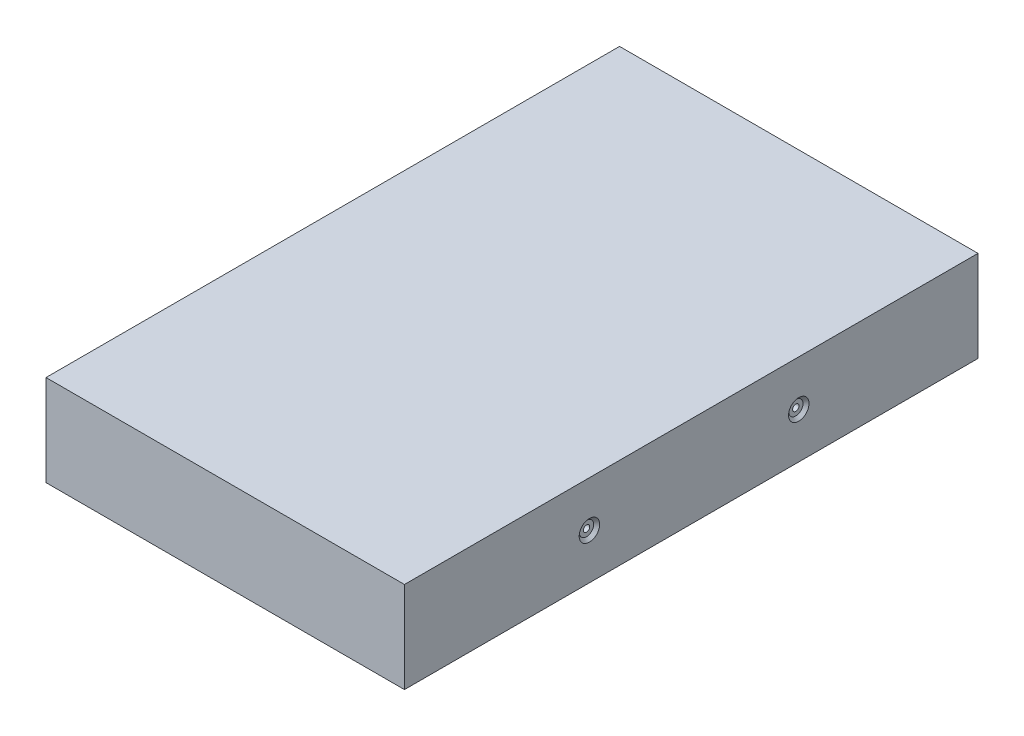
ISO-10303-21;
HEADER;
FILE_DESCRIPTION(('STEP AP214'),'2;1');
FILE_NAME('part.step','',(''),(''),'','','');
FILE_SCHEMA(('AUTOMOTIVE_DESIGN { 1 0 10303 214 1 1 1 1 }'));
ENDSEC;
DATA;
#1=APPLICATION_CONTEXT('core data for automotive mechanical design processes');
#2=APPLICATION_PROTOCOL_DEFINITION('international standard','automotive_design',2000,#1);
#3=PRODUCT_CONTEXT('',#1,'mechanical');
#4=PRODUCT('Part','Part','',(#3));
#5=PRODUCT_RELATED_PRODUCT_CATEGORY('part','',(#4));
#6=PRODUCT_DEFINITION_FORMATION('','',#4);
#7=PRODUCT_DEFINITION_CONTEXT('part definition',#1,'design');
#8=PRODUCT_DEFINITION('design','',#6,#7);
#9=PRODUCT_DEFINITION_SHAPE('','',#8);
#10=(LENGTH_UNIT() NAMED_UNIT(*) SI_UNIT(.MILLI.,.METRE.));
#11=(NAMED_UNIT(*) PLANE_ANGLE_UNIT() SI_UNIT($,.RADIAN.));
#12=(NAMED_UNIT(*) SI_UNIT($,.STERADIAN.) SOLID_ANGLE_UNIT());
#13=UNCERTAINTY_MEASURE_WITH_UNIT(LENGTH_MEASURE(1.E-05),#10,'distance_accuracy_value','');
#14=(GEOMETRIC_REPRESENTATION_CONTEXT(3) GLOBAL_UNCERTAINTY_ASSIGNED_CONTEXT((#13)) GLOBAL_UNIT_ASSIGNED_CONTEXT((#10,
#11,#12)) REPRESENTATION_CONTEXT('',''));
#15=CARTESIAN_POINT('',(0.,0.,0.));
#16=DIRECTION('',(0.,0.,1.));
#17=DIRECTION('',(1.,0.,0.));
#18=AXIS2_PLACEMENT_3D('',#15,#16,#17);
#19=CARTESIAN_POINT('',(50.,25.4,-80.));
#20=DIRECTION('',(-1.,0.,0.));
#21=DIRECTION('',(0.,0.,1.));
#22=AXIS2_PLACEMENT_3D('',#19,#20,#21);
#23=PLANE('',#22);
#24=CARTESIAN_POINT('',(50.,12.7,28.4));
#25=DIRECTION('',(1.,0.,0.));
#26=DIRECTION('',(0.,0.,-1.));
#27=AXIS2_PLACEMENT_3D('',#24,#25,#26);
#28=CIRCLE('',#27,2.8575);
#29=CARTESIAN_POINT('',(50.,12.7,25.5425));
#30=VERTEX_POINT('',#29);
#31=EDGE_CURVE('E176',#30,#30,#28,.T.);
#32=ORIENTED_EDGE('',*,*,#31,.F.);
#33=EDGE_LOOP('',(#32));
#34=FACE_BOUND('',#33,.T.);
#35=CARTESIAN_POINT('',(50.,12.7,-30.));
#36=DIRECTION('',(1.,0.,0.));
#37=DIRECTION('',(0.,0.,-1.));
#38=AXIS2_PLACEMENT_3D('',#35,#36,#37);
#39=CIRCLE('',#38,2.8575);
#40=CARTESIAN_POINT('',(50.,12.7,-32.8575));
#41=VERTEX_POINT('',#40);
#42=EDGE_CURVE('E110',#41,#41,#39,.T.);
#43=ORIENTED_EDGE('',*,*,#42,.F.);
#44=EDGE_LOOP('',(#43));
#45=FACE_BOUND('',#44,.T.);
#46=DIRECTION('',(0.,0.,-1.));
#47=VECTOR('',#46,1.);
#48=CARTESIAN_POINT('',(50.,0.,-80.));
#49=LINE('',#48,#47);
#50=CARTESIAN_POINT('',(50.,0.,80.));
#51=VERTEX_POINT('',#50);
#52=CARTESIAN_POINT('',(50.,0.,-80.));
#53=VERTEX_POINT('',#52);
#54=EDGE_CURVE('E132',#51,#53,#49,.T.);
#55=ORIENTED_EDGE('',*,*,#54,.T.);
#56=DIRECTION('',(0.,-1.,0.));
#57=VECTOR('',#56,1.);
#58=CARTESIAN_POINT('',(50.,25.4,-80.));
#59=LINE('',#58,#57);
#60=CARTESIAN_POINT('',(50.,25.4,-80.));
#61=VERTEX_POINT('',#60);
#62=EDGE_CURVE('E13',#61,#53,#59,.T.);
#63=ORIENTED_EDGE('',*,*,#62,.F.);
#64=DIRECTION('',(0.,0.,-1.));
#65=VECTOR('',#64,1.);
#66=CARTESIAN_POINT('',(50.,25.4,-80.));
#67=LINE('',#66,#65);
#68=CARTESIAN_POINT('',(50.,25.4,80.));
#69=VERTEX_POINT('',#68);
#70=EDGE_CURVE('E133',#69,#61,#67,.T.);
#71=ORIENTED_EDGE('',*,*,#70,.F.);
#72=DIRECTION('',(0.,-1.,0.));
#73=VECTOR('',#72,1.);
#74=CARTESIAN_POINT('',(50.,25.4,80.));
#75=LINE('',#74,#73);
#76=EDGE_CURVE('E139',#69,#51,#75,.T.);
#77=ORIENTED_EDGE('',*,*,#76,.T.);
#78=EDGE_LOOP('',(#55,#63,#71,#77));
#79=FACE_BOUND('',#78,.T.);
#80=ADVANCED_FACE('F46',(#34,#45,#79),#23,.F.);
#81=CARTESIAN_POINT('',(-50.,25.4,-80.));
#82=DIRECTION('',(0.,0.,1.));
#83=DIRECTION('',(1.,0.,0.));
#84=AXIS2_PLACEMENT_3D('',#81,#82,#83);
#85=PLANE('',#84);
#86=DIRECTION('',(-1.,0.,0.));
#87=VECTOR('',#86,1.);
#88=CARTESIAN_POINT('',(-50.,0.,-80.));
#89=LINE('',#88,#87);
#90=CARTESIAN_POINT('',(-50.,0.,-80.));
#91=VERTEX_POINT('',#90);
#92=EDGE_CURVE('E142',#53,#91,#89,.T.);
#93=ORIENTED_EDGE('',*,*,#92,.T.);
#94=DIRECTION('',(0.,-1.,0.));
#95=VECTOR('',#94,1.);
#96=CARTESIAN_POINT('',(-50.,25.4,-80.));
#97=LINE('',#96,#95);
#98=CARTESIAN_POINT('',(-50.,25.4,-80.));
#99=VERTEX_POINT('',#98);
#100=EDGE_CURVE('E54',#99,#91,#97,.T.);
#101=ORIENTED_EDGE('',*,*,#100,.F.);
#102=DIRECTION('',(-1.,0.,0.));
#103=VECTOR('',#102,1.);
#104=CARTESIAN_POINT('',(-50.,25.4,-80.));
#105=LINE('',#104,#103);
#106=EDGE_CURVE('E93',#61,#99,#105,.T.);
#107=ORIENTED_EDGE('',*,*,#106,.F.);
#108=ORIENTED_EDGE('',*,*,#62,.T.);
#109=EDGE_LOOP('',(#93,#101,#107,#108));
#110=FACE_BOUND('',#109,.T.);
#111=ADVANCED_FACE('F165',(#110),#85,.F.);
#112=CARTESIAN_POINT('',(-50.,25.4,-80.));
#113=DIRECTION('',(1.,0.,0.));
#114=DIRECTION('',(0.,0.,-1.));
#115=AXIS2_PLACEMENT_3D('',#112,#113,#114);
#116=PLANE('',#115);
#117=DIRECTION('',(0.,0.,1.));
#118=VECTOR('',#117,1.);
#119=CARTESIAN_POINT('',(-50.,0.,-80.));
#120=LINE('',#119,#118);
#121=CARTESIAN_POINT('',(-50.,0.,80.));
#122=VERTEX_POINT('',#121);
#123=EDGE_CURVE('E80',#91,#122,#120,.T.);
#124=ORIENTED_EDGE('',*,*,#123,.T.);
#125=DIRECTION('',(0.,-1.,0.));
#126=VECTOR('',#125,1.);
#127=CARTESIAN_POINT('',(-50.,25.4,80.));
#128=LINE('',#127,#126);
#129=CARTESIAN_POINT('',(-50.,25.4,80.));
#130=VERTEX_POINT('',#129);
#131=EDGE_CURVE('E147',#130,#122,#128,.T.);
#132=ORIENTED_EDGE('',*,*,#131,.F.);
#133=DIRECTION('',(0.,0.,1.));
#134=VECTOR('',#133,1.);
#135=CARTESIAN_POINT('',(-50.,25.4,-80.));
#136=LINE('',#135,#134);
#137=EDGE_CURVE('E136',#99,#130,#136,.T.);
#138=ORIENTED_EDGE('',*,*,#137,.F.);
#139=ORIENTED_EDGE('',*,*,#100,.T.);
#140=EDGE_LOOP('',(#124,#132,#138,#139));
#141=FACE_BOUND('',#140,.T.);
#142=ADVANCED_FACE('F149',(#141),#116,.F.);
#143=CARTESIAN_POINT('',(-50.,25.4,80.));
#144=DIRECTION('',(0.,0.,-1.));
#145=DIRECTION('',(-1.,0.,0.));
#146=AXIS2_PLACEMENT_3D('',#143,#144,#145);
#147=PLANE('',#146);
#148=DIRECTION('',(1.,0.,0.));
#149=VECTOR('',#148,1.);
#150=CARTESIAN_POINT('',(-50.,0.,80.));
#151=LINE('',#150,#149);
#152=EDGE_CURVE('E86',#122,#51,#151,.T.);
#153=ORIENTED_EDGE('',*,*,#152,.T.);
#154=ORIENTED_EDGE('',*,*,#76,.F.);
#155=DIRECTION('',(1.,0.,0.));
#156=VECTOR('',#155,1.);
#157=CARTESIAN_POINT('',(-50.,25.4,80.));
#158=LINE('',#157,#156);
#159=EDGE_CURVE('E62',#130,#69,#158,.T.);
#160=ORIENTED_EDGE('',*,*,#159,.F.);
#161=ORIENTED_EDGE('',*,*,#131,.T.);
#162=EDGE_LOOP('',(#153,#154,#160,#161));
#163=FACE_BOUND('',#162,.T.);
#164=ADVANCED_FACE('F156',(#163),#147,.F.);
#165=CARTESIAN_POINT('',(0.,25.4,0.));
#166=DIRECTION('',(0.,1.,0.));
#167=DIRECTION('',(0.,0.,1.));
#168=AXIS2_PLACEMENT_3D('',#165,#166,#167);
#169=PLANE('',#168);
#170=ORIENTED_EDGE('',*,*,#70,.T.);
#171=ORIENTED_EDGE('',*,*,#106,.T.);
#172=ORIENTED_EDGE('',*,*,#137,.T.);
#173=ORIENTED_EDGE('',*,*,#159,.T.);
#174=EDGE_LOOP('',(#170,#171,#172,#173));
#175=FACE_BOUND('',#174,.T.);
#176=ADVANCED_FACE('F158',(#175),#169,.T.);
#177=CARTESIAN_POINT('',(0.,0.,0.));
#178=DIRECTION('',(0.,1.,0.));
#179=DIRECTION('',(0.,0.,1.));
#180=AXIS2_PLACEMENT_3D('',#177,#178,#179);
#181=PLANE('',#180);
#182=ORIENTED_EDGE('',*,*,#54,.F.);
#183=ORIENTED_EDGE('',*,*,#152,.F.);
#184=ORIENTED_EDGE('',*,*,#123,.F.);
#185=ORIENTED_EDGE('',*,*,#92,.F.);
#186=EDGE_LOOP('',(#182,#183,#184,#185));
#187=FACE_BOUND('',#186,.T.);
#188=ADVANCED_FACE('F152',(#187),#181,.F.);
#189=CARTESIAN_POINT('',(20.,12.7,-30.));
#190=DIRECTION('',(1.,0.,0.));
#191=DIRECTION('',(0.,0.,-1.));
#192=AXIS2_PLACEMENT_3D('',#189,#190,#191);
#193=CONICAL_SURFACE('',#192,0.888999999999992,1.02974425867665);
#194=CARTESIAN_POINT('',(19.4658349096845,12.7,-30.));
#195=VERTEX_POINT('',#194);
#196=VERTEX_LOOP('',#195);
#197=FACE_BOUND('',#196,.T.);
#198=CARTESIAN_POINT('',(20.,12.7,-30.));
#199=DIRECTION('',(1.,0.,0.));
#200=DIRECTION('',(0.,0.,-1.));
#201=AXIS2_PLACEMENT_3D('',#198,#199,#200);
#202=CIRCLE('',#201,0.888999999999992);
#203=CARTESIAN_POINT('',(20.,12.7,-30.889));
#204=VERTEX_POINT('',#203);
#205=EDGE_CURVE('E129',#204,#204,#202,.T.);
#206=ORIENTED_EDGE('',*,*,#205,.T.);
#207=EDGE_LOOP('',(#206));
#208=FACE_BOUND('',#207,.T.);
#209=ADVANCED_FACE('F198',(#197,#208),#193,.F.);
#210=CARTESIAN_POINT('',(50.,12.7,-30.));
#211=DIRECTION('',(1.,0.,0.));
#212=DIRECTION('',(0.,0.,-1.));
#213=AXIS2_PLACEMENT_3D('',#210,#211,#212);
#214=CYLINDRICAL_SURFACE('',#213,0.888999999999994);
#215=ORIENTED_EDGE('',*,*,#205,.F.);
#216=EDGE_LOOP('',(#215));
#217=FACE_BOUND('',#216,.T.);
#218=CARTESIAN_POINT('',(49.1872,12.7,-30.));
#219=DIRECTION('',(1.,0.,0.));
#220=DIRECTION('',(0.,0.,-1.));
#221=AXIS2_PLACEMENT_3D('',#218,#219,#220);
#222=CIRCLE('',#221,0.888999999999996);
#223=CARTESIAN_POINT('',(49.1872,12.7,-30.889));
#224=VERTEX_POINT('',#223);
#225=EDGE_CURVE('E126',#224,#224,#222,.T.);
#226=ORIENTED_EDGE('',*,*,#225,.T.);
#227=EDGE_LOOP('',(#226));
#228=FACE_BOUND('',#227,.T.);
#229=ADVANCED_FACE('F194',(#217,#228),#214,.F.);
#230=CARTESIAN_POINT('',(49.1872,13.589,-30.));
#231=DIRECTION('',(-1.,0.,0.));
#232=DIRECTION('',(0.,0.,1.));
#233=AXIS2_PLACEMENT_3D('',#230,#231,#232);
#234=PLANE('',#233);
#235=ORIENTED_EDGE('',*,*,#225,.F.);
#236=EDGE_LOOP('',(#235));
#237=FACE_BOUND('',#236,.T.);
#238=CARTESIAN_POINT('',(49.1872,12.7,-30.));
#239=DIRECTION('',(1.,0.,0.));
#240=DIRECTION('',(0.,0.,-1.));
#241=AXIS2_PLACEMENT_3D('',#238,#239,#240);
#242=CIRCLE('',#241,1.98501);
#243=CARTESIAN_POINT('',(49.1872,12.7,-31.98501));
#244=VERTEX_POINT('',#243);
#245=EDGE_CURVE('E123',#244,#244,#242,.T.);
#246=ORIENTED_EDGE('',*,*,#245,.T.);
#247=EDGE_LOOP('',(#246));
#248=FACE_BOUND('',#247,.T.);
#249=ADVANCED_FACE('F186',(#237,#248),#234,.F.);
#250=CARTESIAN_POINT('',(50.,12.7,-30.));
#251=DIRECTION('',(1.,0.,0.));
#252=DIRECTION('',(0.,0.,-1.));
#253=AXIS2_PLACEMENT_3D('',#250,#251,#252);
#254=CYLINDRICAL_SURFACE('',#253,1.98501);
#255=ORIENTED_EDGE('',*,*,#245,.F.);
#256=EDGE_LOOP('',(#255));
#257=FACE_BOUND('',#256,.T.);
#258=CARTESIAN_POINT('',(49.12751,12.7,-30.));
#259=DIRECTION('',(1.,0.,0.));
#260=DIRECTION('',(0.,0.,-1.));
#261=AXIS2_PLACEMENT_3D('',#258,#259,#260);
#262=CIRCLE('',#261,1.98501);
#263=CARTESIAN_POINT('',(49.12751,12.7,-31.98501));
#264=VERTEX_POINT('',#263);
#265=EDGE_CURVE('E114',#264,#264,#262,.T.);
#266=ORIENTED_EDGE('',*,*,#265,.T.);
#267=EDGE_LOOP('',(#266));
#268=FACE_BOUND('',#267,.T.);
#269=ADVANCED_FACE('F180',(#257,#268),#254,.T.);
#270=CARTESIAN_POINT('',(50.,12.7,-30.));
#271=DIRECTION('',(1.,0.,0.));
#272=DIRECTION('',(0.,0.,-1.));
#273=AXIS2_PLACEMENT_3D('',#270,#271,#272);
#274=CONICAL_SURFACE('',#273,2.8575,0.785398163397449);
#275=ORIENTED_EDGE('',*,*,#265,.F.);
#276=EDGE_LOOP('',(#275));
#277=FACE_BOUND('',#276,.T.);
#278=ORIENTED_EDGE('',*,*,#42,.T.);
#279=EDGE_LOOP('',(#278));
#280=FACE_BOUND('',#279,.T.);
#281=ADVANCED_FACE('F104',(#277,#280),#274,.F.);
#282=CARTESIAN_POINT('',(20.,12.7,28.4));
#283=DIRECTION('',(1.,0.,0.));
#284=DIRECTION('',(0.,0.,-1.));
#285=AXIS2_PLACEMENT_3D('',#282,#283,#284);
#286=CONICAL_SURFACE('',#285,0.888999999999992,1.02974425867665);
#287=CARTESIAN_POINT('',(19.4658349096845,12.7,28.4));
#288=VERTEX_POINT('',#287);
#289=VERTEX_LOOP('',#288);
#290=FACE_BOUND('',#289,.T.);
#291=CARTESIAN_POINT('',(20.,12.7,28.4));
#292=DIRECTION('',(1.,0.,0.));
#293=DIRECTION('',(0.,0.,-1.));
#294=AXIS2_PLACEMENT_3D('',#291,#292,#293);
#295=CIRCLE('',#294,0.888999999999992);
#296=CARTESIAN_POINT('',(20.,12.7,27.511));
#297=VERTEX_POINT('',#296);
#298=EDGE_CURVE('E108',#297,#297,#295,.T.);
#299=ORIENTED_EDGE('',*,*,#298,.T.);
#300=EDGE_LOOP('',(#299));
#301=FACE_BOUND('',#300,.T.);
#302=ADVANCED_FACE('F100',(#290,#301),#286,.F.);
#303=CARTESIAN_POINT('',(50.,12.7,28.4));
#304=DIRECTION('',(1.,0.,0.));
#305=DIRECTION('',(0.,0.,-1.));
#306=AXIS2_PLACEMENT_3D('',#303,#304,#305);
#307=CYLINDRICAL_SURFACE('',#306,0.888999999999994);
#308=ORIENTED_EDGE('',*,*,#298,.F.);
#309=EDGE_LOOP('',(#308));
#310=FACE_BOUND('',#309,.T.);
#311=CARTESIAN_POINT('',(49.1872,12.7,28.4));
#312=DIRECTION('',(1.,0.,0.));
#313=DIRECTION('',(0.,0.,-1.));
#314=AXIS2_PLACEMENT_3D('',#311,#312,#313);
#315=CIRCLE('',#314,0.888999999999996);
#316=CARTESIAN_POINT('',(49.1872,12.7,27.511));
#317=VERTEX_POINT('',#316);
#318=EDGE_CURVE('E111',#317,#317,#315,.T.);
#319=ORIENTED_EDGE('',*,*,#318,.T.);
#320=EDGE_LOOP('',(#319));
#321=FACE_BOUND('',#320,.T.);
#322=ADVANCED_FACE('F103',(#310,#321),#307,.F.);
#323=CARTESIAN_POINT('',(49.1872,13.589,28.4));
#324=DIRECTION('',(-1.,0.,0.));
#325=DIRECTION('',(0.,0.,1.));
#326=AXIS2_PLACEMENT_3D('',#323,#324,#325);
#327=PLANE('',#326);
#328=ORIENTED_EDGE('',*,*,#318,.F.);
#329=EDGE_LOOP('',(#328));
#330=FACE_BOUND('',#329,.T.);
#331=CARTESIAN_POINT('',(49.1872,12.7,28.4));
#332=DIRECTION('',(1.,0.,0.));
#333=DIRECTION('',(0.,0.,-1.));
#334=AXIS2_PLACEMENT_3D('',#331,#332,#333);
#335=CIRCLE('',#334,1.98501);
#336=CARTESIAN_POINT('',(49.1872,12.7,26.41499));
#337=VERTEX_POINT('',#336);
#338=EDGE_CURVE('E117',#337,#337,#335,.T.);
#339=ORIENTED_EDGE('',*,*,#338,.T.);
#340=EDGE_LOOP('',(#339));
#341=FACE_BOUND('',#340,.T.);
#342=ADVANCED_FACE('F242',(#330,#341),#327,.F.);
#343=CARTESIAN_POINT('',(50.,12.7,28.4));
#344=DIRECTION('',(1.,0.,0.));
#345=DIRECTION('',(0.,0.,-1.));
#346=AXIS2_PLACEMENT_3D('',#343,#344,#345);
#347=CYLINDRICAL_SURFACE('',#346,1.98501);
#348=ORIENTED_EDGE('',*,*,#338,.F.);
#349=EDGE_LOOP('',(#348));
#350=FACE_BOUND('',#349,.T.);
#351=CARTESIAN_POINT('',(49.12751,12.7,28.4));
#352=DIRECTION('',(1.,0.,0.));
#353=DIRECTION('',(0.,0.,-1.));
#354=AXIS2_PLACEMENT_3D('',#351,#352,#353);
#355=CIRCLE('',#354,1.98501);
#356=CARTESIAN_POINT('',(49.12751,12.7,26.41499));
#357=VERTEX_POINT('',#356);
#358=EDGE_CURVE('E277',#357,#357,#355,.T.);
#359=ORIENTED_EDGE('',*,*,#358,.T.);
#360=EDGE_LOOP('',(#359));
#361=FACE_BOUND('',#360,.T.);
#362=ADVANCED_FACE('F250',(#350,#361),#347,.T.);
#363=CARTESIAN_POINT('',(50.,12.7,28.4));
#364=DIRECTION('',(1.,0.,0.));
#365=DIRECTION('',(0.,0.,-1.));
#366=AXIS2_PLACEMENT_3D('',#363,#364,#365);
#367=CONICAL_SURFACE('',#366,2.8575,0.785398163397449);
#368=ORIENTED_EDGE('',*,*,#358,.F.);
#369=EDGE_LOOP('',(#368));
#370=FACE_BOUND('',#369,.T.);
#371=ORIENTED_EDGE('',*,*,#31,.T.);
#372=EDGE_LOOP('',(#371));
#373=FACE_BOUND('',#372,.T.);
#374=ADVANCED_FACE('F260',(#370,#373),#367,.F.);
#375=CLOSED_SHELL('',(#80,#111,#142,#164,#176,#188,#209,#229,#249,#269,#281,#302,#322,#342,#362,#374));
#376=MANIFOLD_SOLID_BREP('B2',#375);
#377=ADVANCED_BREP_SHAPE_REPRESENTATION('',(#18,#376),#14);
#378=SHAPE_DEFINITION_REPRESENTATION(#9,#377);
ENDSEC;
END-ISO-10303-21;
